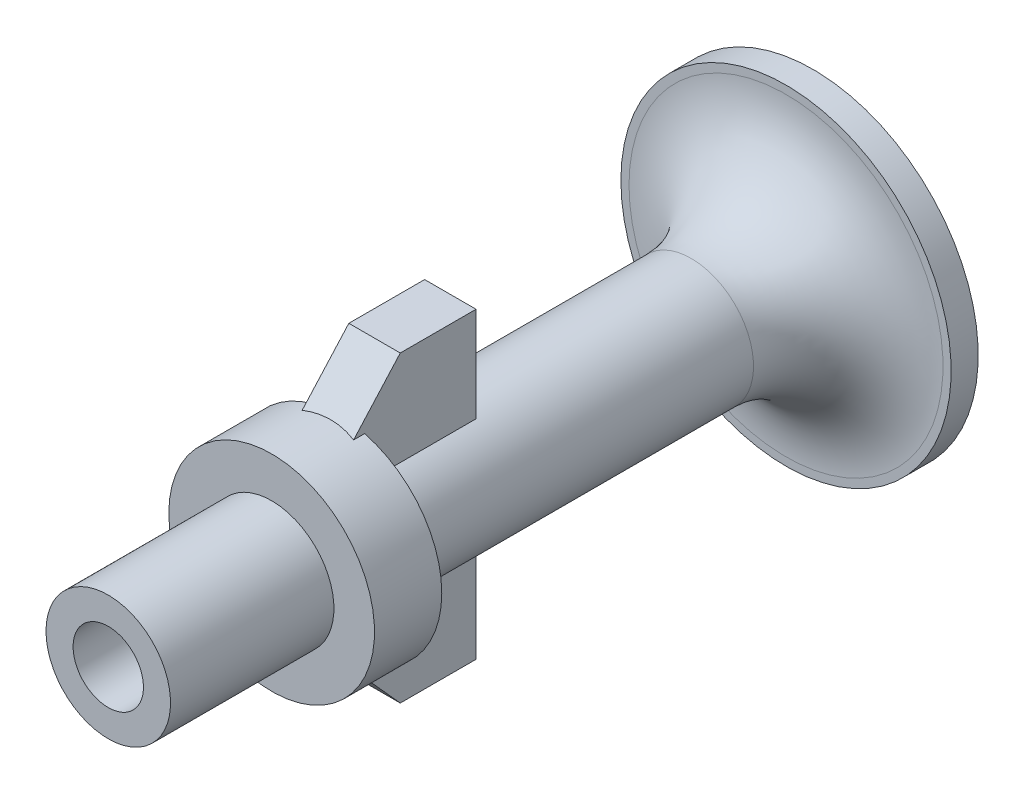
ISO-10303-21;
HEADER;
FILE_DESCRIPTION(('STEP AP214'),'2;1');
FILE_NAME('part.step','',(''),(''),'','','');
FILE_SCHEMA(('AUTOMOTIVE_DESIGN { 1 0 10303 214 1 1 1 1 }'));
ENDSEC;
DATA;
#1=APPLICATION_CONTEXT('core data for automotive mechanical design processes');
#2=APPLICATION_PROTOCOL_DEFINITION('international standard','automotive_design',2000,#1);
#3=PRODUCT_CONTEXT('',#1,'mechanical');
#4=PRODUCT('Part','Part','',(#3));
#5=PRODUCT_RELATED_PRODUCT_CATEGORY('part','',(#4));
#6=PRODUCT_DEFINITION_FORMATION('','',#4);
#7=PRODUCT_DEFINITION_CONTEXT('part definition',#1,'design');
#8=PRODUCT_DEFINITION('design','',#6,#7);
#9=PRODUCT_DEFINITION_SHAPE('','',#8);
#10=(LENGTH_UNIT() NAMED_UNIT(*) SI_UNIT(.MILLI.,.METRE.));
#11=(NAMED_UNIT(*) PLANE_ANGLE_UNIT() SI_UNIT($,.RADIAN.));
#12=(NAMED_UNIT(*) SI_UNIT($,.STERADIAN.) SOLID_ANGLE_UNIT());
#13=UNCERTAINTY_MEASURE_WITH_UNIT(LENGTH_MEASURE(1.E-05),#10,'distance_accuracy_value','');
#14=(GEOMETRIC_REPRESENTATION_CONTEXT(3) GLOBAL_UNCERTAINTY_ASSIGNED_CONTEXT((#13)) GLOBAL_UNIT_ASSIGNED_CONTEXT((#10,
#11,#12)) REPRESENTATION_CONTEXT('',''));
#15=CARTESIAN_POINT('',(0.,0.,0.));
#16=DIRECTION('',(0.,0.,1.));
#17=DIRECTION('',(1.,0.,0.));
#18=AXIS2_PLACEMENT_3D('',#15,#16,#17);
#19=CARTESIAN_POINT('',(0.,3.8,-18.9834509427076));
#20=DIRECTION('',(0.,0.,-1.));
#21=DIRECTION('',(-1.,0.,0.));
#22=AXIS2_PLACEMENT_3D('',#19,#20,#21);
#23=PLANE('',#22);
#24=CARTESIAN_POINT('',(0.,0.,-18.9834509427076));
#25=DIRECTION('',(0.,0.,-1.));
#26=DIRECTION('',(-1.,0.,0.));
#27=AXIS2_PLACEMENT_3D('',#24,#25,#26);
#28=CIRCLE('',#27,3.8);
#29=CARTESIAN_POINT('',(0.95,3.67933417889705,-18.9834509427076));
#30=VERTEX_POINT('',#29);
#31=CARTESIAN_POINT('',(0.95,-3.67933417889705,-18.9834509427076));
#32=VERTEX_POINT('',#31);
#33=EDGE_CURVE('E196',#30,#32,#28,.T.);
#34=ORIENTED_EDGE('',*,*,#33,.T.);
#35=DIRECTION('',(0.,1.,0.));
#36=VECTOR('',#35,1.);
#37=CARTESIAN_POINT('',(0.95,3.8,-18.9834509427076));
#38=LINE('',#37,#36);
#39=CARTESIAN_POINT('',(0.95,-2.09463600656534,-18.9834509427076));
#40=VERTEX_POINT('',#39);
#41=EDGE_CURVE('E51',#32,#40,#38,.T.);
#42=ORIENTED_EDGE('',*,*,#41,.T.);
#43=CARTESIAN_POINT('',(0.,0.,-18.9834509427076));
#44=DIRECTION('',(0.,0.,-1.));
#45=DIRECTION('',(-1.,0.,0.));
#46=AXIS2_PLACEMENT_3D('',#43,#44,#45);
#47=CIRCLE('',#46,2.3);
#48=CARTESIAN_POINT('',(0.95,2.09463600656534,-18.9834509427076));
#49=VERTEX_POINT('',#48);
#50=EDGE_CURVE('E233',#49,#40,#47,.T.);
#51=ORIENTED_EDGE('',*,*,#50,.F.);
#52=DIRECTION('',(0.,1.,0.));
#53=VECTOR('',#52,1.);
#54=CARTESIAN_POINT('',(0.95,3.8,-18.9834509427076));
#55=LINE('',#54,#53);
#56=EDGE_CURVE('E182',#49,#30,#55,.T.);
#57=ORIENTED_EDGE('',*,*,#56,.T.);
#58=EDGE_LOOP('',(#34,#42,#51,#57));
#59=FACE_BOUND('',#58,.T.);
#60=ADVANCED_FACE('F36',(#59),#23,.T.);
#61=DIRECTION('',(0.,1.,0.));
#62=VECTOR('',#61,1.);
#63=CARTESIAN_POINT('',(-0.95,3.8,-18.9834509427076));
#64=LINE('',#63,#62);
#65=CARTESIAN_POINT('',(-0.95,-3.67933417889705,-18.9834509427076));
#66=VERTEX_POINT('',#65);
#67=CARTESIAN_POINT('',(-0.95,-2.09463600656534,-18.9834509427076));
#68=VERTEX_POINT('',#67);
#69=EDGE_CURVE('E161',#66,#68,#64,.T.);
#70=ORIENTED_EDGE('',*,*,#69,.F.);
#71=CARTESIAN_POINT('',(-0.95,3.67933417889705,-18.9834509427076));
#72=VERTEX_POINT('',#71);
#73=EDGE_CURVE('E195',#66,#72,#28,.T.);
#74=ORIENTED_EDGE('',*,*,#73,.T.);
#75=DIRECTION('',(0.,1.,0.));
#76=VECTOR('',#75,1.);
#77=CARTESIAN_POINT('',(-0.95,3.8,-18.9834509427076));
#78=LINE('',#77,#76);
#79=CARTESIAN_POINT('',(-0.95,2.09463600656534,-18.9834509427076));
#80=VERTEX_POINT('',#79);
#81=EDGE_CURVE('E189',#80,#72,#78,.T.);
#82=ORIENTED_EDGE('',*,*,#81,.F.);
#83=EDGE_CURVE('E232',#68,#80,#47,.T.);
#84=ORIENTED_EDGE('',*,*,#83,.F.);
#85=EDGE_LOOP('',(#70,#74,#82,#84));
#86=FACE_BOUND('',#85,.T.);
#87=ADVANCED_FACE('F38',(#86),#23,.T.);
#88=CARTESIAN_POINT('',(0.,0.,-15.3));
#89=DIRECTION('',(0.,0.,-1.));
#90=DIRECTION('',(-1.,0.,0.));
#91=AXIS2_PLACEMENT_3D('',#88,#89,#90);
#92=CYLINDRICAL_SURFACE('',#91,2.3);
#93=DIRECTION('',(0.,0.,-1.));
#94=VECTOR('',#93,1.);
#95=CARTESIAN_POINT('',(-0.95,-2.09463600656534,-15.3));
#96=LINE('',#95,#94);
#97=CARTESIAN_POINT('',(-0.95,-2.09463600656534,-23.1));
#98=VERTEX_POINT('',#97);
#99=EDGE_CURVE('E163',#68,#98,#96,.T.);
#100=ORIENTED_EDGE('',*,*,#99,.F.);
#101=ORIENTED_EDGE('',*,*,#83,.T.);
#102=DIRECTION('',(0.,0.,-1.));
#103=VECTOR('',#102,1.);
#104=CARTESIAN_POINT('',(-0.95,2.09463600656534,-15.3));
#105=LINE('',#104,#103);
#106=CARTESIAN_POINT('',(-0.95,2.09463600656534,-23.1));
#107=VERTEX_POINT('',#106);
#108=EDGE_CURVE('E192',#107,#80,#105,.F.);
#109=ORIENTED_EDGE('',*,*,#108,.F.);
#110=CARTESIAN_POINT('',(0.,0.,-23.1));
#111=DIRECTION('',(0.,0.,-1.));
#112=DIRECTION('',(-1.,0.,0.));
#113=AXIS2_PLACEMENT_3D('',#110,#111,#112);
#114=CIRCLE('',#113,2.3);
#115=CARTESIAN_POINT('',(0.95,2.09463600656534,-23.1));
#116=VERTEX_POINT('',#115);
#117=EDGE_CURVE('E243',#116,#107,#114,.F.);
#118=ORIENTED_EDGE('',*,*,#117,.F.);
#119=DIRECTION('',(0.,0.,-1.));
#120=VECTOR('',#119,1.);
#121=CARTESIAN_POINT('',(0.95,2.09463600656534,-15.3));
#122=LINE('',#121,#120);
#123=EDGE_CURVE('E186',#116,#49,#122,.F.);
#124=ORIENTED_EDGE('',*,*,#123,.T.);
#125=ORIENTED_EDGE('',*,*,#50,.T.);
#126=DIRECTION('',(0.,0.,-1.));
#127=VECTOR('',#126,1.);
#128=CARTESIAN_POINT('',(0.95,-2.09463600656534,-15.3));
#129=LINE('',#128,#127);
#130=CARTESIAN_POINT('',(0.95,-2.09463600656534,-23.1));
#131=VERTEX_POINT('',#130);
#132=EDGE_CURVE('E158',#40,#131,#129,.T.);
#133=ORIENTED_EDGE('',*,*,#132,.T.);
#134=CARTESIAN_POINT('',(0.,0.,-23.1));
#135=DIRECTION('',(0.,0.,-1.));
#136=DIRECTION('',(-1.,0.,0.));
#137=AXIS2_PLACEMENT_3D('',#134,#135,#136);
#138=CIRCLE('',#137,2.3);
#139=EDGE_CURVE('E11',#98,#131,#138,.F.);
#140=ORIENTED_EDGE('',*,*,#139,.F.);
#141=EDGE_LOOP('',(#100,#101,#109,#118,#124,#125,#133,#140));
#142=FACE_BOUND('',#141,.T.);
#143=CARTESIAN_POINT('',(0.,0.,-32.));
#144=DIRECTION('',(0.,0.,-1.));
#145=DIRECTION('',(-1.,0.,0.));
#146=AXIS2_PLACEMENT_3D('',#143,#144,#145);
#147=CIRCLE('',#146,2.3);
#148=CARTESIAN_POINT('',(-2.3,0.,-32.));
#149=VERTEX_POINT('',#148);
#150=EDGE_CURVE('E229',#149,#149,#147,.T.);
#151=ORIENTED_EDGE('',*,*,#150,.F.);
#152=EDGE_LOOP('',(#151));
#153=FACE_BOUND('',#152,.T.);
#154=ADVANCED_FACE('F276',(#142,#153),#92,.T.);
#155=CARTESIAN_POINT('',(0.,0.,-32.));
#156=DIRECTION('',(0.,0.,-1.));
#157=DIRECTION('',(-1.,0.,0.));
#158=AXIS2_PLACEMENT_3D('',#155,#156,#157);
#159=TOROIDAL_SURFACE('',#158,5.8,3.5);
#160=ORIENTED_EDGE('',*,*,#150,.T.);
#161=EDGE_LOOP('',(#160));
#162=FACE_BOUND('',#161,.T.);
#163=CARTESIAN_POINT('',(0.,0.,-35.5));
#164=DIRECTION('',(0.,0.,-1.));
#165=DIRECTION('',(-1.,0.,0.));
#166=AXIS2_PLACEMENT_3D('',#163,#164,#165);
#167=CIRCLE('',#166,5.8);
#168=CARTESIAN_POINT('',(-5.8,0.,-35.5));
#169=VERTEX_POINT('',#168);
#170=EDGE_CURVE('E226',#169,#169,#167,.T.);
#171=ORIENTED_EDGE('',*,*,#170,.F.);
#172=EDGE_LOOP('',(#171));
#173=FACE_BOUND('',#172,.T.);
#174=ADVANCED_FACE('F304',(#162,#173),#159,.F.);
#175=CARTESIAN_POINT('',(0.,6.1,-35.5));
#176=DIRECTION('',(0.,0.,1.));
#177=DIRECTION('',(1.,0.,0.));
#178=AXIS2_PLACEMENT_3D('',#175,#176,#177);
#179=PLANE('',#178);
#180=ORIENTED_EDGE('',*,*,#170,.T.);
#181=EDGE_LOOP('',(#180));
#182=FACE_BOUND('',#181,.T.);
#183=CARTESIAN_POINT('',(0.,0.,-35.5));
#184=DIRECTION('',(0.,0.,-1.));
#185=DIRECTION('',(-1.,0.,0.));
#186=AXIS2_PLACEMENT_3D('',#183,#184,#185);
#187=CIRCLE('',#186,6.1);
#188=CARTESIAN_POINT('',(-6.1,0.,-35.5));
#189=VERTEX_POINT('',#188);
#190=EDGE_CURVE('E223',#189,#189,#187,.T.);
#191=ORIENTED_EDGE('',*,*,#190,.F.);
#192=EDGE_LOOP('',(#191));
#193=FACE_BOUND('',#192,.T.);
#194=ADVANCED_FACE('F308',(#182,#193),#179,.T.);
#195=CARTESIAN_POINT('',(0.,0.,-15.3));
#196=DIRECTION('',(0.,0.,-1.));
#197=DIRECTION('',(-1.,0.,0.));
#198=AXIS2_PLACEMENT_3D('',#195,#196,#197);
#199=CYLINDRICAL_SURFACE('',#198,6.1);
#200=ORIENTED_EDGE('',*,*,#190,.T.);
#201=EDGE_LOOP('',(#200));
#202=FACE_BOUND('',#201,.T.);
#203=CARTESIAN_POINT('',(0.,0.,-36.5));
#204=DIRECTION('',(0.,0.,-1.));
#205=DIRECTION('',(-1.,0.,0.));
#206=AXIS2_PLACEMENT_3D('',#203,#204,#205);
#207=CIRCLE('',#206,6.1);
#208=CARTESIAN_POINT('',(-6.1,0.,-36.5));
#209=VERTEX_POINT('',#208);
#210=EDGE_CURVE('E220',#209,#209,#207,.T.);
#211=ORIENTED_EDGE('',*,*,#210,.F.);
#212=EDGE_LOOP('',(#211));
#213=FACE_BOUND('',#212,.T.);
#214=ADVANCED_FACE('F314',(#202,#213),#199,.T.);
#215=CARTESIAN_POINT('',(0.,5.07821169243101,-36.5));
#216=DIRECTION('',(0.,0.,-1.));
#217=DIRECTION('',(-1.,0.,0.));
#218=AXIS2_PLACEMENT_3D('',#215,#216,#217);
#219=PLANE('',#218);
#220=ORIENTED_EDGE('',*,*,#210,.T.);
#221=EDGE_LOOP('',(#220));
#222=FACE_BOUND('',#221,.T.);
#223=CARTESIAN_POINT('',(0.,0.,-36.5));
#224=DIRECTION('',(0.,0.,-1.));
#225=DIRECTION('',(-1.,0.,0.));
#226=AXIS2_PLACEMENT_3D('',#223,#224,#225);
#227=CIRCLE('',#226,5.07821169243101);
#228=CARTESIAN_POINT('',(-5.07821169243101,0.,-36.5));
#229=VERTEX_POINT('',#228);
#230=EDGE_CURVE('E217',#229,#229,#227,.T.);
#231=ORIENTED_EDGE('',*,*,#230,.F.);
#232=EDGE_LOOP('',(#231));
#233=FACE_BOUND('',#232,.T.);
#234=ADVANCED_FACE('F318',(#222,#233),#219,.T.);
#235=CARTESIAN_POINT('',(0.,0.,-34.771119214602));
#236=DIRECTION('',(0.,0.,-1.));
#237=DIRECTION('',(-1.,0.,0.));
#238=AXIS2_PLACEMENT_3D('',#235,#236,#237);
#239=CONICAL_SURFACE('',#238,2.72674277009046,0.936812385071372);
#240=ORIENTED_EDGE('',*,*,#230,.T.);
#241=EDGE_LOOP('',(#240));
#242=FACE_BOUND('',#241,.T.);
#243=CARTESIAN_POINT('',(0.,0.,-34.771119214602));
#244=DIRECTION('',(0.,0.,-1.));
#245=DIRECTION('',(-1.,0.,0.));
#246=AXIS2_PLACEMENT_3D('',#243,#244,#245);
#247=CIRCLE('',#246,2.72674277009046);
#248=CARTESIAN_POINT('',(-2.72674277009046,0.,-34.771119214602));
#249=VERTEX_POINT('',#248);
#250=EDGE_CURVE('E214',#249,#249,#247,.T.);
#251=ORIENTED_EDGE('',*,*,#250,.F.);
#252=EDGE_LOOP('',(#251));
#253=FACE_BOUND('',#252,.T.);
#254=ADVANCED_FACE('F322',(#242,#253),#239,.F.);
#255=CARTESIAN_POINT('',(0.,0.,-31.9512602715646));
#256=DIRECTION('',(0.,0.,-1.));
#257=DIRECTION('',(-1.,0.,0.));
#258=AXIS2_PLACEMENT_3D('',#255,#256,#257);
#259=TOROIDAL_SURFACE('',#258,4.8,3.5);
#260=ORIENTED_EDGE('',*,*,#250,.T.);
#261=EDGE_LOOP('',(#260));
#262=FACE_BOUND('',#261,.T.);
#263=CARTESIAN_POINT('',(0.,0.,-31.9512602715646));
#264=DIRECTION('',(0.,0.,-1.));
#265=DIRECTION('',(-1.,0.,0.));
#266=AXIS2_PLACEMENT_3D('',#263,#264,#265);
#267=CIRCLE('',#266,1.3);
#268=CARTESIAN_POINT('',(-1.3,0.,-31.9512602715646));
#269=VERTEX_POINT('',#268);
#270=EDGE_CURVE('E211',#269,#269,#267,.T.);
#271=ORIENTED_EDGE('',*,*,#270,.F.);
#272=EDGE_LOOP('',(#271));
#273=FACE_BOUND('',#272,.T.);
#274=ADVANCED_FACE('F326',(#262,#273),#259,.T.);
#275=CARTESIAN_POINT('',(0.,0.,-15.3));
#276=DIRECTION('',(0.,0.,-1.));
#277=DIRECTION('',(-1.,0.,0.));
#278=AXIS2_PLACEMENT_3D('',#275,#276,#277);
#279=CYLINDRICAL_SURFACE('',#278,1.3);
#280=ORIENTED_EDGE('',*,*,#270,.T.);
#281=EDGE_LOOP('',(#280));
#282=FACE_BOUND('',#281,.T.);
#283=CARTESIAN_POINT('',(0.,0.,-10.4632746162293));
#284=DIRECTION('',(0.,0.,-1.));
#285=DIRECTION('',(-1.,0.,0.));
#286=AXIS2_PLACEMENT_3D('',#283,#284,#285);
#287=CIRCLE('',#286,1.3);
#288=CARTESIAN_POINT('',(-1.3,0.,-10.4632746162293));
#289=VERTEX_POINT('',#288);
#290=EDGE_CURVE('E208',#289,#289,#287,.T.);
#291=ORIENTED_EDGE('',*,*,#290,.F.);
#292=EDGE_LOOP('',(#291));
#293=FACE_BOUND('',#292,.T.);
#294=ADVANCED_FACE('F330',(#282,#293),#279,.F.);
#295=CARTESIAN_POINT('',(0.,2.3,-10.4632746162293));
#296=DIRECTION('',(0.,0.,1.));
#297=DIRECTION('',(1.,0.,0.));
#298=AXIS2_PLACEMENT_3D('',#295,#296,#297);
#299=PLANE('',#298);
#300=ORIENTED_EDGE('',*,*,#290,.T.);
#301=EDGE_LOOP('',(#300));
#302=FACE_BOUND('',#301,.T.);
#303=CARTESIAN_POINT('',(0.,0.,-10.4632746162293));
#304=DIRECTION('',(0.,0.,-1.));
#305=DIRECTION('',(-1.,0.,0.));
#306=AXIS2_PLACEMENT_3D('',#303,#304,#305);
#307=CIRCLE('',#306,2.3);
#308=CARTESIAN_POINT('',(-2.3,0.,-10.4632746162293));
#309=VERTEX_POINT('',#308);
#310=EDGE_CURVE('E205',#309,#309,#307,.T.);
#311=ORIENTED_EDGE('',*,*,#310,.F.);
#312=EDGE_LOOP('',(#311));
#313=FACE_BOUND('',#312,.T.);
#314=ADVANCED_FACE('F334',(#302,#313),#299,.T.);
#315=CARTESIAN_POINT('',(0.,0.,-15.3));
#316=DIRECTION('',(0.,0.,-1.));
#317=DIRECTION('',(-1.,0.,0.));
#318=AXIS2_PLACEMENT_3D('',#315,#316,#317);
#319=CYLINDRICAL_SURFACE('',#318,2.3);
#320=ORIENTED_EDGE('',*,*,#310,.T.);
#321=EDGE_LOOP('',(#320));
#322=FACE_BOUND('',#321,.T.);
#323=CARTESIAN_POINT('',(0.,0.,-16.49938008933));
#324=DIRECTION('',(0.,0.,-1.));
#325=DIRECTION('',(-1.,0.,0.));
#326=AXIS2_PLACEMENT_3D('',#323,#324,#325);
#327=CIRCLE('',#326,2.3);
#328=CARTESIAN_POINT('',(-2.3,0.,-16.49938008933));
#329=VERTEX_POINT('',#328);
#330=EDGE_CURVE('E202',#329,#329,#327,.T.);
#331=ORIENTED_EDGE('',*,*,#330,.F.);
#332=EDGE_LOOP('',(#331));
#333=FACE_BOUND('',#332,.T.);
#334=ADVANCED_FACE('F338',(#322,#333),#319,.T.);
#335=CARTESIAN_POINT('',(0.,2.3,-16.49938008933));
#336=DIRECTION('',(0.,0.,1.));
#337=DIRECTION('',(1.,0.,0.));
#338=AXIS2_PLACEMENT_3D('',#335,#336,#337);
#339=PLANE('',#338);
#340=ORIENTED_EDGE('',*,*,#330,.T.);
#341=EDGE_LOOP('',(#340));
#342=FACE_BOUND('',#341,.T.);
#343=CARTESIAN_POINT('',(0.,0.,-16.49938008933));
#344=DIRECTION('',(0.,0.,-1.));
#345=DIRECTION('',(-1.,0.,0.));
#346=AXIS2_PLACEMENT_3D('',#343,#344,#345);
#347=CIRCLE('',#346,3.8);
#348=CARTESIAN_POINT('',(-3.8,0.,-16.49938008933));
#349=VERTEX_POINT('',#348);
#350=EDGE_CURVE('E199',#349,#349,#347,.T.);
#351=ORIENTED_EDGE('',*,*,#350,.F.);
#352=EDGE_LOOP('',(#351));
#353=FACE_BOUND('',#352,.T.);
#354=ADVANCED_FACE('F342',(#342,#353),#339,.T.);
#355=CARTESIAN_POINT('',(0.,0.,-15.3));
#356=DIRECTION('',(0.,0.,-1.));
#357=DIRECTION('',(-1.,0.,0.));
#358=AXIS2_PLACEMENT_3D('',#355,#356,#357);
#359=CYLINDRICAL_SURFACE('',#358,3.8);
#360=DIRECTION('',(0.,0.,-1.));
#361=VECTOR('',#360,1.);
#362=CARTESIAN_POINT('',(-0.95,-3.67933417889705,-15.3));
#363=LINE('',#362,#361);
#364=CARTESIAN_POINT('',(-0.95,-3.67933417889705,-18.5756615270209));
#365=VERTEX_POINT('',#364);
#366=EDGE_CURVE('E44',#365,#66,#363,.T.);
#367=ORIENTED_EDGE('',*,*,#366,.F.);
#368=CARTESIAN_POINT('',(0.,0.,-15.2724229261613));
#369=DIRECTION('',(0.,-0.668052223517139,0.744114390839075));
#370=DIRECTION('',(0.,-0.744114390839075,-0.668052223517139));
#371=AXIS2_PLACEMENT_3D('',#368,#369,#370);
#372=ELLIPSE('',#371,5.10674171442252,3.8);
#373=CARTESIAN_POINT('',(0.95,-3.67933417889705,-18.5756615270209));
#374=VERTEX_POINT('',#373);
#375=EDGE_CURVE('E246',#374,#365,#372,.F.);
#376=ORIENTED_EDGE('',*,*,#375,.F.);
#377=DIRECTION('',(0.,0.,-1.));
#378=VECTOR('',#377,1.);
#379=CARTESIAN_POINT('',(0.95,-3.67933417889705,-15.3));
#380=LINE('',#379,#378);
#381=EDGE_CURVE('E131',#374,#32,#380,.T.);
#382=ORIENTED_EDGE('',*,*,#381,.T.);
#383=ORIENTED_EDGE('',*,*,#33,.F.);
#384=DIRECTION('',(0.,0.,-1.));
#385=VECTOR('',#384,1.);
#386=CARTESIAN_POINT('',(0.95,3.67933417889705,-15.3));
#387=LINE('',#386,#385);
#388=CARTESIAN_POINT('',(0.95,3.67933417889705,-18.5756615270209));
#389=VERTEX_POINT('',#388);
#390=EDGE_CURVE('E236',#30,#389,#387,.F.);
#391=ORIENTED_EDGE('',*,*,#390,.T.);
#392=CARTESIAN_POINT('',(0.,0.,-15.2724229261613));
#393=DIRECTION('',(0.,0.668052223517138,0.744114390839075));
#394=DIRECTION('',(0.,0.744114390839075,-0.668052223517139));
#395=AXIS2_PLACEMENT_3D('',#392,#393,#394);
#396=ELLIPSE('',#395,5.10674171442252,3.8);
#397=CARTESIAN_POINT('',(-0.95,3.67933417889705,-18.5756615270209));
#398=VERTEX_POINT('',#397);
#399=EDGE_CURVE('E239',#398,#389,#396,.F.);
#400=ORIENTED_EDGE('',*,*,#399,.F.);
#401=DIRECTION('',(0.,0.,-1.));
#402=VECTOR('',#401,1.);
#403=CARTESIAN_POINT('',(-0.95,3.67933417889705,-15.3));
#404=LINE('',#403,#402);
#405=EDGE_CURVE('E241',#72,#398,#404,.F.);
#406=ORIENTED_EDGE('',*,*,#405,.F.);
#407=ORIENTED_EDGE('',*,*,#73,.F.);
#408=EDGE_LOOP('',(#367,#376,#382,#383,#391,#400,#406,#407));
#409=FACE_BOUND('',#408,.T.);
#410=ORIENTED_EDGE('',*,*,#350,.T.);
#411=EDGE_LOOP('',(#410));
#412=FACE_BOUND('',#411,.T.);
#413=ADVANCED_FACE('F258',(#409,#412),#359,.T.);
#414=CARTESIAN_POINT('',(-0.95,5.6,-23.1));
#415=DIRECTION('',(0.,1.,0.));
#416=DIRECTION('',(0.,0.,1.));
#417=AXIS2_PLACEMENT_3D('',#414,#415,#416);
#418=PLANE('',#417);
#419=DIRECTION('',(1.,0.,0.));
#420=VECTOR('',#419,1.);
#421=CARTESIAN_POINT('',(-0.95,5.6,-20.3));
#422=LINE('',#421,#420);
#423=CARTESIAN_POINT('',(-0.95,5.6,-20.3));
#424=VERTEX_POINT('',#423);
#425=CARTESIAN_POINT('',(0.95,5.6,-20.3));
#426=VERTEX_POINT('',#425);
#427=EDGE_CURVE('E178',#424,#426,#422,.T.);
#428=ORIENTED_EDGE('',*,*,#427,.T.);
#429=DIRECTION('',(0.,0.,1.));
#430=VECTOR('',#429,1.);
#431=CARTESIAN_POINT('',(0.95,5.6,-23.1));
#432=LINE('',#431,#430);
#433=CARTESIAN_POINT('',(0.95,5.6,-23.1));
#434=VERTEX_POINT('',#433);
#435=EDGE_CURVE('E165',#434,#426,#432,.T.);
#436=ORIENTED_EDGE('',*,*,#435,.F.);
#437=DIRECTION('',(1.,0.,0.));
#438=VECTOR('',#437,1.);
#439=CARTESIAN_POINT('',(-0.95,5.6,-23.1));
#440=LINE('',#439,#438);
#441=CARTESIAN_POINT('',(-0.95,5.6,-23.1));
#442=VERTEX_POINT('',#441);
#443=EDGE_CURVE('E179',#442,#434,#440,.T.);
#444=ORIENTED_EDGE('',*,*,#443,.F.);
#445=DIRECTION('',(0.,0.,1.));
#446=VECTOR('',#445,1.);
#447=CARTESIAN_POINT('',(-0.95,5.6,-23.1));
#448=LINE('',#447,#446);
#449=EDGE_CURVE('E170',#442,#424,#448,.T.);
#450=ORIENTED_EDGE('',*,*,#449,.T.);
#451=EDGE_LOOP('',(#428,#436,#444,#450));
#452=FACE_BOUND('',#451,.T.);
#453=ADVANCED_FACE('F270',(#452),#418,.T.);
#454=CARTESIAN_POINT('',(-0.95,1.46073754085388,-23.1));
#455=DIRECTION('',(0.,0.,-1.));
#456=DIRECTION('',(-1.,0.,0.));
#457=AXIS2_PLACEMENT_3D('',#454,#455,#456);
#458=PLANE('',#457);
#459=DIRECTION('',(0.,1.,0.));
#460=VECTOR('',#459,1.);
#461=CARTESIAN_POINT('',(0.95,1.46073754085388,-23.1));
#462=LINE('',#461,#460);
#463=EDGE_CURVE('E168',#116,#434,#462,.T.);
#464=ORIENTED_EDGE('',*,*,#463,.F.);
#465=ORIENTED_EDGE('',*,*,#117,.T.);
#466=DIRECTION('',(0.,1.,0.));
#467=VECTOR('',#466,1.);
#468=CARTESIAN_POINT('',(-0.95,1.46073754085388,-23.1));
#469=LINE('',#468,#467);
#470=EDGE_CURVE('E176',#107,#442,#469,.T.);
#471=ORIENTED_EDGE('',*,*,#470,.T.);
#472=ORIENTED_EDGE('',*,*,#443,.T.);
#473=EDGE_LOOP('',(#464,#465,#471,#472));
#474=FACE_BOUND('',#473,.T.);
#475=ADVANCED_FACE('F287',(#474),#458,.T.);
#476=CARTESIAN_POINT('',(-0.95,5.6,-20.3));
#477=DIRECTION('',(0.,0.668052223517138,0.744114390839075));
#478=DIRECTION('',(0.,-0.744114390839075,0.668052223517139));
#479=AXIS2_PLACEMENT_3D('',#476,#477,#478);
#480=PLANE('',#479);
#481=DIRECTION('',(0.,-0.744114390839075,0.668052223517138));
#482=VECTOR('',#481,1.);
#483=CARTESIAN_POINT('',(-0.95,5.6,-20.3));
#484=LINE('',#483,#482);
#485=EDGE_CURVE('E173',#424,#398,#484,.T.);
#486=ORIENTED_EDGE('',*,*,#485,.T.);
#487=ORIENTED_EDGE('',*,*,#399,.T.);
#488=DIRECTION('',(0.,-0.744114390839075,0.668052223517138));
#489=VECTOR('',#488,1.);
#490=CARTESIAN_POINT('',(0.95,5.6,-20.3));
#491=LINE('',#490,#489);
#492=EDGE_CURVE('E59',#426,#389,#491,.T.);
#493=ORIENTED_EDGE('',*,*,#492,.F.);
#494=ORIENTED_EDGE('',*,*,#427,.F.);
#495=EDGE_LOOP('',(#486,#487,#493,#494));
#496=FACE_BOUND('',#495,.T.);
#497=ADVANCED_FACE('F267',(#496),#480,.T.);
#498=CARTESIAN_POINT('',(-0.95,0.,0.));
#499=DIRECTION('',(-1.,0.,0.));
#500=DIRECTION('',(0.,0.,1.));
#501=AXIS2_PLACEMENT_3D('',#498,#499,#500);
#502=PLANE('',#501);
#503=ORIENTED_EDGE('',*,*,#470,.F.);
#504=ORIENTED_EDGE('',*,*,#108,.T.);
#505=ORIENTED_EDGE('',*,*,#81,.T.);
#506=ORIENTED_EDGE('',*,*,#405,.T.);
#507=ORIENTED_EDGE('',*,*,#485,.F.);
#508=ORIENTED_EDGE('',*,*,#449,.F.);
#509=EDGE_LOOP('',(#503,#504,#505,#506,#507,#508));
#510=FACE_BOUND('',#509,.T.);
#511=ADVANCED_FACE('F264',(#510),#502,.T.);
#512=CARTESIAN_POINT('',(0.95,0.,0.));
#513=DIRECTION('',(-1.,0.,0.));
#514=DIRECTION('',(0.,0.,1.));
#515=AXIS2_PLACEMENT_3D('',#512,#513,#514);
#516=PLANE('',#515);
#517=ORIENTED_EDGE('',*,*,#123,.F.);
#518=ORIENTED_EDGE('',*,*,#463,.T.);
#519=ORIENTED_EDGE('',*,*,#435,.T.);
#520=ORIENTED_EDGE('',*,*,#492,.T.);
#521=ORIENTED_EDGE('',*,*,#390,.F.);
#522=ORIENTED_EDGE('',*,*,#56,.F.);
#523=EDGE_LOOP('',(#517,#518,#519,#520,#521,#522));
#524=FACE_BOUND('',#523,.T.);
#525=ADVANCED_FACE('F285',(#524),#516,.F.);
#526=CARTESIAN_POINT('',(-0.95,-5.6,-20.3));
#527=DIRECTION('',(0.,-0.668052223517139,0.744114390839075));
#528=DIRECTION('',(0.,-0.744114390839075,-0.668052223517139));
#529=AXIS2_PLACEMENT_3D('',#526,#527,#528);
#530=PLANE('',#529);
#531=DIRECTION('',(0.,-0.744114390839075,-0.668052223517139));
#532=VECTOR('',#531,1.);
#533=CARTESIAN_POINT('',(0.95,-5.6,-20.3));
#534=LINE('',#533,#532);
#535=CARTESIAN_POINT('',(0.95,-5.6,-20.3));
#536=VERTEX_POINT('',#535);
#537=EDGE_CURVE('E124',#374,#536,#534,.T.);
#538=ORIENTED_EDGE('',*,*,#537,.F.);
#539=ORIENTED_EDGE('',*,*,#375,.T.);
#540=DIRECTION('',(0.,-0.744114390839075,-0.668052223517139));
#541=VECTOR('',#540,1.);
#542=CARTESIAN_POINT('',(-0.95,-5.6,-20.3));
#543=LINE('',#542,#541);
#544=CARTESIAN_POINT('',(-0.95,-5.6,-20.3));
#545=VERTEX_POINT('',#544);
#546=EDGE_CURVE('E139',#365,#545,#543,.T.);
#547=ORIENTED_EDGE('',*,*,#546,.T.);
#548=DIRECTION('',(1.,0.,0.));
#549=VECTOR('',#548,1.);
#550=CARTESIAN_POINT('',(-0.95,-5.6,-20.3));
#551=LINE('',#550,#549);
#552=EDGE_CURVE('E136',#545,#536,#551,.T.);
#553=ORIENTED_EDGE('',*,*,#552,.T.);
#554=EDGE_LOOP('',(#538,#539,#547,#553));
#555=FACE_BOUND('',#554,.T.);
#556=ADVANCED_FACE('F137',(#555),#530,.T.);
#557=CARTESIAN_POINT('',(-0.95,-1.46073754085388,-23.1));
#558=DIRECTION('',(0.,0.,-1.));
#559=DIRECTION('',(-1.,0.,0.));
#560=AXIS2_PLACEMENT_3D('',#557,#558,#559);
#561=PLANE('',#560);
#562=DIRECTION('',(0.,1.,0.));
#563=VECTOR('',#562,1.);
#564=CARTESIAN_POINT('',(-0.95,-1.46073754085388,-23.1));
#565=LINE('',#564,#563);
#566=CARTESIAN_POINT('',(-0.95,-5.6,-23.1));
#567=VERTEX_POINT('',#566);
#568=EDGE_CURVE('E144',#567,#98,#565,.T.);
#569=ORIENTED_EDGE('',*,*,#568,.T.);
#570=ORIENTED_EDGE('',*,*,#139,.T.);
#571=DIRECTION('',(0.,1.,0.));
#572=VECTOR('',#571,1.);
#573=CARTESIAN_POINT('',(0.95,-1.46073754085388,-23.1));
#574=LINE('',#573,#572);
#575=CARTESIAN_POINT('',(0.95,-5.6,-23.1));
#576=VERTEX_POINT('',#575);
#577=EDGE_CURVE('E147',#576,#131,#574,.T.);
#578=ORIENTED_EDGE('',*,*,#577,.F.);
#579=DIRECTION('',(1.,0.,0.));
#580=VECTOR('',#579,1.);
#581=CARTESIAN_POINT('',(-0.95,-5.6,-23.1));
#582=LINE('',#581,#580);
#583=EDGE_CURVE('E143',#567,#576,#582,.T.);
#584=ORIENTED_EDGE('',*,*,#583,.F.);
#585=EDGE_LOOP('',(#569,#570,#578,#584));
#586=FACE_BOUND('',#585,.T.);
#587=ADVANCED_FACE('F281',(#586),#561,.T.);
#588=CARTESIAN_POINT('',(-0.95,-5.6,-23.1));
#589=DIRECTION('',(0.,-1.,0.));
#590=DIRECTION('',(0.,0.,-1.));
#591=AXIS2_PLACEMENT_3D('',#588,#589,#590);
#592=PLANE('',#591);
#593=ORIENTED_EDGE('',*,*,#583,.T.);
#594=DIRECTION('',(0.,0.,-1.));
#595=VECTOR('',#594,1.);
#596=CARTESIAN_POINT('',(0.95,-5.6,-23.1));
#597=LINE('',#596,#595);
#598=EDGE_CURVE('E129',#536,#576,#597,.T.);
#599=ORIENTED_EDGE('',*,*,#598,.F.);
#600=ORIENTED_EDGE('',*,*,#552,.F.);
#601=DIRECTION('',(0.,0.,-1.));
#602=VECTOR('',#601,1.);
#603=CARTESIAN_POINT('',(-0.95,-5.6,-23.1));
#604=LINE('',#603,#602);
#605=EDGE_CURVE('E152',#545,#567,#604,.T.);
#606=ORIENTED_EDGE('',*,*,#605,.T.);
#607=EDGE_LOOP('',(#593,#599,#600,#606));
#608=FACE_BOUND('',#607,.T.);
#609=ADVANCED_FACE('F146',(#608),#592,.T.);
#610=CARTESIAN_POINT('',(-0.95,0.,0.));
#611=DIRECTION('',(-1.,0.,0.));
#612=DIRECTION('',(0.,0.,1.));
#613=AXIS2_PLACEMENT_3D('',#610,#611,#612);
#614=PLANE('',#613);
#615=ORIENTED_EDGE('',*,*,#69,.T.);
#616=ORIENTED_EDGE('',*,*,#99,.T.);
#617=ORIENTED_EDGE('',*,*,#568,.F.);
#618=ORIENTED_EDGE('',*,*,#605,.F.);
#619=ORIENTED_EDGE('',*,*,#546,.F.);
#620=ORIENTED_EDGE('',*,*,#366,.T.);
#621=EDGE_LOOP('',(#615,#616,#617,#618,#619,#620));
#622=FACE_BOUND('',#621,.T.);
#623=ADVANCED_FACE('F250',(#622),#614,.T.);
#624=CARTESIAN_POINT('',(0.95,0.,0.));
#625=DIRECTION('',(-1.,0.,0.));
#626=DIRECTION('',(0.,0.,1.));
#627=AXIS2_PLACEMENT_3D('',#624,#625,#626);
#628=PLANE('',#627);
#629=ORIENTED_EDGE('',*,*,#132,.F.);
#630=ORIENTED_EDGE('',*,*,#41,.F.);
#631=ORIENTED_EDGE('',*,*,#381,.F.);
#632=ORIENTED_EDGE('',*,*,#537,.T.);
#633=ORIENTED_EDGE('',*,*,#598,.T.);
#634=ORIENTED_EDGE('',*,*,#577,.T.);
#635=EDGE_LOOP('',(#629,#630,#631,#632,#633,#634));
#636=FACE_BOUND('',#635,.T.);
#637=ADVANCED_FACE('F126',(#636),#628,.F.);
#638=CLOSED_SHELL('',(#60,#87,#154,#174,#194,#214,#234,#254,#274,#294,#314,#334,#354,#413,#453,
#475,#497,#511,#525,#556,#587,#609,#623,#637));
#639=MANIFOLD_SOLID_BREP('B2',#638);
#640=ADVANCED_BREP_SHAPE_REPRESENTATION('',(#18,#639),#14);
#641=SHAPE_DEFINITION_REPRESENTATION(#9,#640);
ENDSEC;
END-ISO-10303-21;
